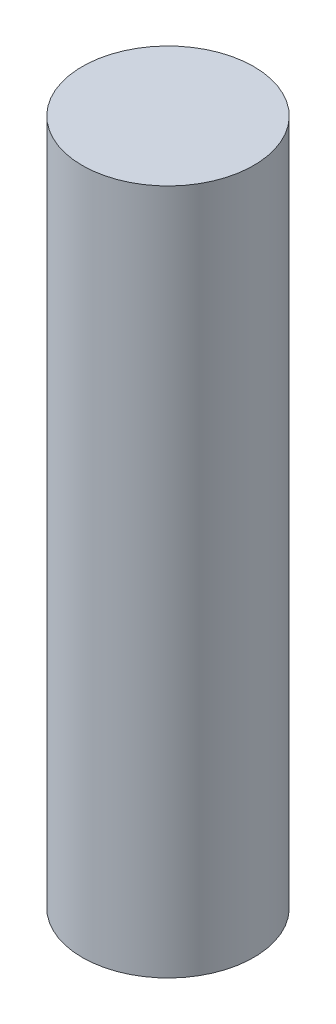
ISO-10303-21;
HEADER;
FILE_DESCRIPTION(('STEP AP214'),'2;1');
FILE_NAME('part.step','',(''),(''),'','','');
FILE_SCHEMA(('AUTOMOTIVE_DESIGN { 1 0 10303 214 1 1 1 1 }'));
ENDSEC;
DATA;
#1=APPLICATION_CONTEXT('core data for automotive mechanical design processes');
#2=APPLICATION_PROTOCOL_DEFINITION('international standard','automotive_design',2000,#1);
#3=PRODUCT_CONTEXT('',#1,'mechanical');
#4=PRODUCT('Part','Part','',(#3));
#5=PRODUCT_RELATED_PRODUCT_CATEGORY('part','',(#4));
#6=PRODUCT_DEFINITION_FORMATION('','',#4);
#7=PRODUCT_DEFINITION_CONTEXT('part definition',#1,'design');
#8=PRODUCT_DEFINITION('design','',#6,#7);
#9=PRODUCT_DEFINITION_SHAPE('','',#8);
#10=(LENGTH_UNIT() NAMED_UNIT(*) SI_UNIT(.MILLI.,.METRE.));
#11=(NAMED_UNIT(*) PLANE_ANGLE_UNIT() SI_UNIT($,.RADIAN.));
#12=(NAMED_UNIT(*) SI_UNIT($,.STERADIAN.) SOLID_ANGLE_UNIT());
#13=UNCERTAINTY_MEASURE_WITH_UNIT(LENGTH_MEASURE(1.E-05),#10,'distance_accuracy_value','');
#14=(GEOMETRIC_REPRESENTATION_CONTEXT(3) GLOBAL_UNCERTAINTY_ASSIGNED_CONTEXT((#13)) GLOBAL_UNIT_ASSIGNED_CONTEXT((#10,
#11,#12)) REPRESENTATION_CONTEXT('',''));
#15=CARTESIAN_POINT('',(0.,0.,0.));
#16=DIRECTION('',(0.,0.,1.));
#17=DIRECTION('',(1.,0.,0.));
#18=AXIS2_PLACEMENT_3D('',#15,#16,#17);
#19=CARTESIAN_POINT('',(0.,12.7,0.));
#20=DIRECTION('',(0.,-1.,0.));
#21=DIRECTION('',(0.,0.,-1.));
#22=AXIS2_PLACEMENT_3D('',#19,#20,#21);
#23=CYLINDRICAL_SURFACE('',#22,3.175);
#24=CARTESIAN_POINT('',(0.,12.7,0.));
#25=DIRECTION('',(0.,1.,0.));
#26=DIRECTION('',(0.,0.,1.));
#27=AXIS2_PLACEMENT_3D('',#24,#25,#26);
#28=CIRCLE('',#27,3.175);
#29=CARTESIAN_POINT('',(0.,12.7,3.175));
#30=VERTEX_POINT('',#29);
#31=EDGE_CURVE('E10',#30,#30,#28,.T.);
#32=ORIENTED_EDGE('',*,*,#31,.F.);
#33=EDGE_LOOP('',(#32));
#34=FACE_BOUND('',#33,.T.);
#35=CARTESIAN_POINT('',(0.,-12.7,0.));
#36=DIRECTION('',(0.,1.,0.));
#37=DIRECTION('',(0.,0.,1.));
#38=AXIS2_PLACEMENT_3D('',#35,#36,#37);
#39=CIRCLE('',#38,3.175);
#40=CARTESIAN_POINT('',(0.,-12.7,3.175));
#41=VERTEX_POINT('',#40);
#42=EDGE_CURVE('E44',#41,#41,#39,.T.);
#43=ORIENTED_EDGE('',*,*,#42,.T.);
#44=EDGE_LOOP('',(#43));
#45=FACE_BOUND('',#44,.T.);
#46=ADVANCED_FACE('F41',(#34,#45),#23,.T.);
#47=CARTESIAN_POINT('',(0.,12.7,0.));
#48=DIRECTION('',(0.,1.,0.));
#49=DIRECTION('',(0.,0.,1.));
#50=AXIS2_PLACEMENT_3D('',#47,#48,#49);
#51=PLANE('',#50);
#52=ORIENTED_EDGE('',*,*,#31,.T.);
#53=EDGE_LOOP('',(#52));
#54=FACE_BOUND('',#53,.T.);
#55=ADVANCED_FACE('F58',(#54),#51,.T.);
#56=CARTESIAN_POINT('',(0.,-12.7,0.));
#57=DIRECTION('',(0.,1.,0.));
#58=DIRECTION('',(0.,0.,1.));
#59=AXIS2_PLACEMENT_3D('',#56,#57,#58);
#60=PLANE('',#59);
#61=ORIENTED_EDGE('',*,*,#42,.F.);
#62=EDGE_LOOP('',(#61));
#63=FACE_BOUND('',#62,.T.);
#64=ADVANCED_FACE('F56',(#63),#60,.F.);
#65=CLOSED_SHELL('',(#46,#55,#64));
#66=MANIFOLD_SOLID_BREP('B2',#65);
#67=ADVANCED_BREP_SHAPE_REPRESENTATION('',(#18,#66),#14);
#68=SHAPE_DEFINITION_REPRESENTATION(#9,#67);
ENDSEC;
END-ISO-10303-21;
